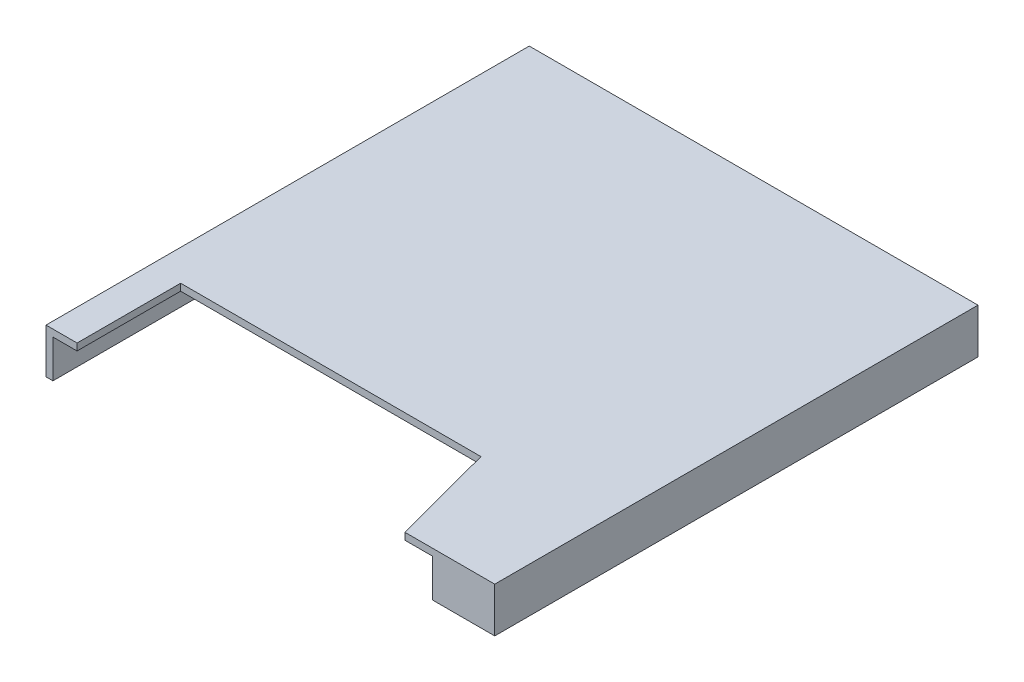
ISO-10303-21;
HEADER;
FILE_DESCRIPTION(('STEP AP214'),'2;1');
FILE_NAME('part.step','',(''),(''),'','','');
FILE_SCHEMA(('AUTOMOTIVE_DESIGN { 1 0 10303 214 1 1 1 1 }'));
ENDSEC;
DATA;
#1=APPLICATION_CONTEXT('core data for automotive mechanical design processes');
#2=APPLICATION_PROTOCOL_DEFINITION('international standard','automotive_design',2000,#1);
#3=PRODUCT_CONTEXT('',#1,'mechanical');
#4=PRODUCT('Part','Part','',(#3));
#5=PRODUCT_RELATED_PRODUCT_CATEGORY('part','',(#4));
#6=PRODUCT_DEFINITION_FORMATION('','',#4);
#7=PRODUCT_DEFINITION_CONTEXT('part definition',#1,'design');
#8=PRODUCT_DEFINITION('design','',#6,#7);
#9=PRODUCT_DEFINITION_SHAPE('','',#8);
#10=(LENGTH_UNIT() NAMED_UNIT(*) SI_UNIT(.MILLI.,.METRE.));
#11=(NAMED_UNIT(*) PLANE_ANGLE_UNIT() SI_UNIT($,.RADIAN.));
#12=(NAMED_UNIT(*) SI_UNIT($,.STERADIAN.) SOLID_ANGLE_UNIT());
#13=UNCERTAINTY_MEASURE_WITH_UNIT(LENGTH_MEASURE(1.E-05),#10,'distance_accuracy_value','');
#14=(GEOMETRIC_REPRESENTATION_CONTEXT(3) GLOBAL_UNCERTAINTY_ASSIGNED_CONTEXT((#13)) GLOBAL_UNIT_ASSIGNED_CONTEXT((#10,
#11,#12)) REPRESENTATION_CONTEXT('',''));
#15=CARTESIAN_POINT('',(0.,0.,0.));
#16=DIRECTION('',(0.,0.,1.));
#17=DIRECTION('',(1.,0.,0.));
#18=AXIS2_PLACEMENT_3D('',#15,#16,#17);
#19=CARTESIAN_POINT('',(-6.3,0.,-7.));
#20=DIRECTION('',(-1.,0.,0.));
#21=DIRECTION('',(0.,0.,1.));
#22=AXIS2_PLACEMENT_3D('',#19,#20,#21);
#23=PLANE('',#22);
#24=DIRECTION('',(0.,1.,0.));
#25=VECTOR('',#24,1.);
#26=CARTESIAN_POINT('',(-6.3,0.,7.));
#27=LINE('',#26,#25);
#28=CARTESIAN_POINT('',(-6.3,0.,7.));
#29=VERTEX_POINT('',#28);
#30=CARTESIAN_POINT('',(-6.3,1.1,7.));
#31=VERTEX_POINT('',#30);
#32=EDGE_CURVE('E20',#29,#31,#27,.T.);
#33=ORIENTED_EDGE('',*,*,#32,.F.);
#34=DIRECTION('',(0.,0.,1.));
#35=VECTOR('',#34,1.);
#36=CARTESIAN_POINT('',(-6.3,0.,0.));
#37=LINE('',#36,#35);
#38=CARTESIAN_POINT('',(-6.3,0.,-6.8));
#39=VERTEX_POINT('',#38);
#40=EDGE_CURVE('E196',#29,#39,#37,.F.);
#41=ORIENTED_EDGE('',*,*,#40,.T.);
#42=DIRECTION('',(0.,1.,0.));
#43=VECTOR('',#42,1.);
#44=CARTESIAN_POINT('',(-6.3,0.,-6.8));
#45=LINE('',#44,#43);
#46=CARTESIAN_POINT('',(-6.3,1.1,-6.8));
#47=VERTEX_POINT('',#46);
#48=EDGE_CURVE('E149',#39,#47,#45,.T.);
#49=ORIENTED_EDGE('',*,*,#48,.T.);
#50=DIRECTION('',(0.,0.,1.));
#51=VECTOR('',#50,1.);
#52=CARTESIAN_POINT('',(-6.3,1.1,0.));
#53=LINE('',#52,#51);
#54=EDGE_CURVE('E145',#47,#31,#53,.T.);
#55=ORIENTED_EDGE('',*,*,#54,.T.);
#56=EDGE_LOOP('',(#33,#41,#49,#55));
#57=FACE_BOUND('',#56,.T.);
#58=ADVANCED_FACE('F17',(#57),#23,.F.);
#59=CARTESIAN_POINT('',(6.5,0.,-6.8));
#60=DIRECTION('',(0.,0.,-1.));
#61=DIRECTION('',(-1.,0.,0.));
#62=AXIS2_PLACEMENT_3D('',#59,#60,#61);
#63=PLANE('',#62);
#64=ORIENTED_EDGE('',*,*,#48,.F.);
#65=DIRECTION('',(1.,0.,0.));
#66=VECTOR('',#65,1.);
#67=CARTESIAN_POINT('',(0.,0.,-6.8));
#68=LINE('',#67,#66);
#69=CARTESIAN_POINT('',(6.3,0.,-6.8));
#70=VERTEX_POINT('',#69);
#71=EDGE_CURVE('E194',#39,#70,#68,.T.);
#72=ORIENTED_EDGE('',*,*,#71,.T.);
#73=DIRECTION('',(0.,1.,0.));
#74=VECTOR('',#73,1.);
#75=CARTESIAN_POINT('',(6.3,0.,-6.8));
#76=LINE('',#75,#74);
#77=CARTESIAN_POINT('',(6.3,1.1,-6.8));
#78=VERTEX_POINT('',#77);
#79=EDGE_CURVE('E116',#70,#78,#76,.T.);
#80=ORIENTED_EDGE('',*,*,#79,.T.);
#81=DIRECTION('',(1.,0.,0.));
#82=VECTOR('',#81,1.);
#83=CARTESIAN_POINT('',(0.,1.1,-6.8));
#84=LINE('',#83,#82);
#85=EDGE_CURVE('E143',#78,#47,#84,.F.);
#86=ORIENTED_EDGE('',*,*,#85,.T.);
#87=EDGE_LOOP('',(#64,#72,#80,#86));
#88=FACE_BOUND('',#87,.T.);
#89=ADVANCED_FACE('F378',(#88),#63,.F.);
#90=CARTESIAN_POINT('',(6.3,0.,7.));
#91=DIRECTION('',(1.,0.,0.));
#92=DIRECTION('',(0.,0.,-1.));
#93=AXIS2_PLACEMENT_3D('',#90,#91,#92);
#94=PLANE('',#93);
#95=DIRECTION('',(0.,0.,1.));
#96=VECTOR('',#95,1.);
#97=CARTESIAN_POINT('',(6.3,0.,0.));
#98=LINE('',#97,#96);
#99=CARTESIAN_POINT('',(6.3,0.,6.8));
#100=VERTEX_POINT('',#99);
#101=EDGE_CURVE('E128',#70,#100,#98,.T.);
#102=ORIENTED_EDGE('',*,*,#101,.T.);
#103=DIRECTION('',(0.,1.,0.));
#104=VECTOR('',#103,1.);
#105=CARTESIAN_POINT('',(6.3,1.1,6.8));
#106=LINE('',#105,#104);
#107=CARTESIAN_POINT('',(6.3,1.1,6.8));
#108=VERTEX_POINT('',#107);
#109=EDGE_CURVE('E121',#108,#100,#106,.F.);
#110=ORIENTED_EDGE('',*,*,#109,.F.);
#111=DIRECTION('',(0.,0.,1.));
#112=VECTOR('',#111,1.);
#113=CARTESIAN_POINT('',(6.3,1.1,0.));
#114=LINE('',#113,#112);
#115=EDGE_CURVE('E125',#108,#78,#114,.F.);
#116=ORIENTED_EDGE('',*,*,#115,.T.);
#117=ORIENTED_EDGE('',*,*,#79,.F.);
#118=EDGE_LOOP('',(#102,#110,#116,#117));
#119=FACE_BOUND('',#118,.T.);
#120=ADVANCED_FACE('F123',(#119),#94,.F.);
#121=CARTESIAN_POINT('',(4.7,1.1,6.8));
#122=DIRECTION('',(0.,0.,-1.));
#123=DIRECTION('',(-1.,0.,0.));
#124=AXIS2_PLACEMENT_3D('',#121,#122,#123);
#125=PLANE('',#124);
#126=DIRECTION('',(1.,0.,0.));
#127=VECTOR('',#126,1.);
#128=CARTESIAN_POINT('',(0.,1.1,6.8));
#129=LINE('',#128,#127);
#130=CARTESIAN_POINT('',(4.7,1.1,6.8));
#131=VERTEX_POINT('',#130);
#132=EDGE_CURVE('E131',#131,#108,#129,.T.);
#133=ORIENTED_EDGE('',*,*,#132,.T.);
#134=ORIENTED_EDGE('',*,*,#109,.T.);
#135=DIRECTION('',(1.,0.,0.));
#136=VECTOR('',#135,1.);
#137=CARTESIAN_POINT('',(0.,0.,6.8));
#138=LINE('',#137,#136);
#139=CARTESIAN_POINT('',(4.7,0.,6.8));
#140=VERTEX_POINT('',#139);
#141=EDGE_CURVE('E191',#100,#140,#138,.F.);
#142=ORIENTED_EDGE('',*,*,#141,.T.);
#143=DIRECTION('',(0.,1.,0.));
#144=VECTOR('',#143,1.);
#145=CARTESIAN_POINT('',(4.7,1.1,6.8));
#146=LINE('',#145,#144);
#147=EDGE_CURVE('E136',#131,#140,#146,.F.);
#148=ORIENTED_EDGE('',*,*,#147,.F.);
#149=EDGE_LOOP('',(#133,#134,#142,#148));
#150=FACE_BOUND('',#149,.T.);
#151=ADVANCED_FACE('F134',(#150),#125,.T.);
#152=CARTESIAN_POINT('',(0.,1.1,0.));
#153=DIRECTION('',(0.,1.,0.));
#154=DIRECTION('',(0.,0.,1.));
#155=AXIS2_PLACEMENT_3D('',#152,#153,#154);
#156=PLANE('',#155);
#157=DIRECTION('',(-0.257662650560333,0.,-0.966234939601246));
#158=VECTOR('',#157,1.);
#159=CARTESIAN_POINT('',(3.1,1.1,4.));
#160=LINE('',#159,#158);
#161=CARTESIAN_POINT('',(3.9,1.1,7.));
#162=VERTEX_POINT('',#161);
#163=CARTESIAN_POINT('',(3.1,1.1,4.));
#164=VERTEX_POINT('',#163);
#165=EDGE_CURVE('E216',#162,#164,#160,.T.);
#166=ORIENTED_EDGE('',*,*,#165,.T.);
#167=DIRECTION('',(-1.,0.,0.));
#168=VECTOR('',#167,1.);
#169=CARTESIAN_POINT('',(-5.6,1.1,4.));
#170=LINE('',#169,#168);
#171=CARTESIAN_POINT('',(-5.6,1.1,4.));
#172=VERTEX_POINT('',#171);
#173=EDGE_CURVE('E223',#164,#172,#170,.T.);
#174=ORIENTED_EDGE('',*,*,#173,.T.);
#175=DIRECTION('',(0.,0.,1.));
#176=VECTOR('',#175,1.);
#177=CARTESIAN_POINT('',(-5.6,1.1,7.));
#178=LINE('',#177,#176);
#179=CARTESIAN_POINT('',(-5.6,1.1,7.));
#180=VERTEX_POINT('',#179);
#181=EDGE_CURVE('E166',#172,#180,#178,.T.);
#182=ORIENTED_EDGE('',*,*,#181,.T.);
#183=DIRECTION('',(1.,0.,0.));
#184=VECTOR('',#183,1.);
#185=CARTESIAN_POINT('',(-6.5,1.1,7.));
#186=LINE('',#185,#184);
#187=EDGE_CURVE('E158',#31,#180,#186,.T.);
#188=ORIENTED_EDGE('',*,*,#187,.F.);
#189=ORIENTED_EDGE('',*,*,#54,.F.);
#190=ORIENTED_EDGE('',*,*,#85,.F.);
#191=ORIENTED_EDGE('',*,*,#115,.F.);
#192=ORIENTED_EDGE('',*,*,#132,.F.);
#193=DIRECTION('',(0.,0.,1.));
#194=VECTOR('',#193,1.);
#195=CARTESIAN_POINT('',(4.7,1.1,7.));
#196=LINE('',#195,#194);
#197=CARTESIAN_POINT('',(4.7,1.1,7.));
#198=VERTEX_POINT('',#197);
#199=EDGE_CURVE('E199',#198,#131,#196,.F.);
#200=ORIENTED_EDGE('',*,*,#199,.F.);
#201=DIRECTION('',(1.,0.,0.));
#202=VECTOR('',#201,1.);
#203=CARTESIAN_POINT('',(0.,1.1,7.));
#204=LINE('',#203,#202);
#205=EDGE_CURVE('E164',#162,#198,#204,.T.);
#206=ORIENTED_EDGE('',*,*,#205,.F.);
#207=EDGE_LOOP('',(#166,#174,#182,#188,#189,#190,#191,#192,#200,#206));
#208=FACE_BOUND('',#207,.T.);
#209=ADVANCED_FACE('F141',(#208),#156,.F.);
#210=CARTESIAN_POINT('',(4.7,1.1,7.));
#211=DIRECTION('',(-1.,0.,0.));
#212=DIRECTION('',(0.,0.,1.));
#213=AXIS2_PLACEMENT_3D('',#210,#211,#212);
#214=PLANE('',#213);
#215=ORIENTED_EDGE('',*,*,#199,.T.);
#216=ORIENTED_EDGE('',*,*,#147,.T.);
#217=DIRECTION('',(0.,0.,1.));
#218=VECTOR('',#217,1.);
#219=CARTESIAN_POINT('',(4.7,0.,0.));
#220=LINE('',#219,#218);
#221=CARTESIAN_POINT('',(4.7,0.,7.));
#222=VERTEX_POINT('',#221);
#223=EDGE_CURVE('E189',#140,#222,#220,.T.);
#224=ORIENTED_EDGE('',*,*,#223,.T.);
#225=DIRECTION('',(0.,1.,0.));
#226=VECTOR('',#225,1.);
#227=CARTESIAN_POINT('',(4.7,0.,7.));
#228=LINE('',#227,#226);
#229=EDGE_CURVE('E206',#198,#222,#228,.F.);
#230=ORIENTED_EDGE('',*,*,#229,.F.);
#231=EDGE_LOOP('',(#215,#216,#224,#230));
#232=FACE_BOUND('',#231,.T.);
#233=ADVANCED_FACE('F208',(#232),#214,.T.);
#234=CARTESIAN_POINT('',(0.,0.,0.));
#235=DIRECTION('',(0.,1.,0.));
#236=DIRECTION('',(0.,0.,1.));
#237=AXIS2_PLACEMENT_3D('',#234,#235,#236);
#238=PLANE('',#237);
#239=DIRECTION('',(-1.,0.,0.));
#240=VECTOR('',#239,1.);
#241=CARTESIAN_POINT('',(6.5,0.,-7.));
#242=LINE('',#241,#240);
#243=CARTESIAN_POINT('',(6.5,0.,-7.));
#244=VERTEX_POINT('',#243);
#245=CARTESIAN_POINT('',(-6.5,0.,-7.));
#246=VERTEX_POINT('',#245);
#247=EDGE_CURVE('E183',#244,#246,#242,.T.);
#248=ORIENTED_EDGE('',*,*,#247,.F.);
#249=DIRECTION('',(0.,0.,-1.));
#250=VECTOR('',#249,1.);
#251=CARTESIAN_POINT('',(6.5,0.,7.));
#252=LINE('',#251,#250);
#253=CARTESIAN_POINT('',(6.5,0.,7.));
#254=VERTEX_POINT('',#253);
#255=EDGE_CURVE('E186',#254,#244,#252,.T.);
#256=ORIENTED_EDGE('',*,*,#255,.F.);
#257=DIRECTION('',(1.,0.,0.));
#258=VECTOR('',#257,1.);
#259=CARTESIAN_POINT('',(-6.5,0.,7.));
#260=LINE('',#259,#258);
#261=EDGE_CURVE('E211',#222,#254,#260,.T.);
#262=ORIENTED_EDGE('',*,*,#261,.F.);
#263=ORIENTED_EDGE('',*,*,#223,.F.);
#264=ORIENTED_EDGE('',*,*,#141,.F.);
#265=ORIENTED_EDGE('',*,*,#101,.F.);
#266=ORIENTED_EDGE('',*,*,#71,.F.);
#267=ORIENTED_EDGE('',*,*,#40,.F.);
#268=DIRECTION('',(1.,0.,0.));
#269=VECTOR('',#268,1.);
#270=CARTESIAN_POINT('',(-6.5,0.,7.));
#271=LINE('',#270,#269);
#272=CARTESIAN_POINT('',(-6.5,0.,7.));
#273=VERTEX_POINT('',#272);
#274=EDGE_CURVE('E162',#273,#29,#271,.T.);
#275=ORIENTED_EDGE('',*,*,#274,.F.);
#276=DIRECTION('',(0.,0.,1.));
#277=VECTOR('',#276,1.);
#278=CARTESIAN_POINT('',(-6.5,0.,-7.));
#279=LINE('',#278,#277);
#280=EDGE_CURVE('E178',#246,#273,#279,.T.);
#281=ORIENTED_EDGE('',*,*,#280,.F.);
#282=EDGE_LOOP('',(#248,#256,#262,#263,#264,#265,#266,#267,#275,#281));
#283=FACE_BOUND('',#282,.T.);
#284=ADVANCED_FACE('F336',(#283),#238,.F.);
#285=CARTESIAN_POINT('',(6.5,0.,7.));
#286=DIRECTION('',(1.,0.,0.));
#287=DIRECTION('',(0.,0.,-1.));
#288=AXIS2_PLACEMENT_3D('',#285,#286,#287);
#289=PLANE('',#288);
#290=DIRECTION('',(0.,0.,1.));
#291=VECTOR('',#290,1.);
#292=CARTESIAN_POINT('',(6.5,1.3,0.));
#293=LINE('',#292,#291);
#294=CARTESIAN_POINT('',(6.5,1.3,7.));
#295=VERTEX_POINT('',#294);
#296=CARTESIAN_POINT('',(6.5,1.3,-7.));
#297=VERTEX_POINT('',#296);
#298=EDGE_CURVE('E250',#295,#297,#293,.F.);
#299=ORIENTED_EDGE('',*,*,#298,.F.);
#300=DIRECTION('',(0.,1.,0.));
#301=VECTOR('',#300,1.);
#302=CARTESIAN_POINT('',(6.5,0.,7.));
#303=LINE('',#302,#301);
#304=EDGE_CURVE('E214',#254,#295,#303,.T.);
#305=ORIENTED_EDGE('',*,*,#304,.F.);
#306=ORIENTED_EDGE('',*,*,#255,.T.);
#307=DIRECTION('',(0.,1.,0.));
#308=VECTOR('',#307,1.);
#309=CARTESIAN_POINT('',(6.5,0.,-7.));
#310=LINE('',#309,#308);
#311=EDGE_CURVE('E180',#297,#244,#310,.F.);
#312=ORIENTED_EDGE('',*,*,#311,.F.);
#313=EDGE_LOOP('',(#299,#305,#306,#312));
#314=FACE_BOUND('',#313,.T.);
#315=ADVANCED_FACE('F326',(#314),#289,.T.);
#316=CARTESIAN_POINT('',(6.5,0.,-7.));
#317=DIRECTION('',(0.,0.,-1.));
#318=DIRECTION('',(-1.,0.,0.));
#319=AXIS2_PLACEMENT_3D('',#316,#317,#318);
#320=PLANE('',#319);
#321=DIRECTION('',(1.,0.,0.));
#322=VECTOR('',#321,1.);
#323=CARTESIAN_POINT('',(0.,1.3,-7.));
#324=LINE('',#323,#322);
#325=CARTESIAN_POINT('',(-6.5,1.3,-7.));
#326=VERTEX_POINT('',#325);
#327=EDGE_CURVE('E245',#297,#326,#324,.F.);
#328=ORIENTED_EDGE('',*,*,#327,.F.);
#329=ORIENTED_EDGE('',*,*,#311,.T.);
#330=ORIENTED_EDGE('',*,*,#247,.T.);
#331=DIRECTION('',(0.,1.,0.));
#332=VECTOR('',#331,1.);
#333=CARTESIAN_POINT('',(-6.5,0.,-7.));
#334=LINE('',#333,#332);
#335=EDGE_CURVE('E175',#326,#246,#334,.F.);
#336=ORIENTED_EDGE('',*,*,#335,.F.);
#337=EDGE_LOOP('',(#328,#329,#330,#336));
#338=FACE_BOUND('',#337,.T.);
#339=ADVANCED_FACE('F316',(#338),#320,.T.);
#340=CARTESIAN_POINT('',(-6.5,0.,-7.));
#341=DIRECTION('',(-1.,0.,0.));
#342=DIRECTION('',(0.,0.,1.));
#343=AXIS2_PLACEMENT_3D('',#340,#341,#342);
#344=PLANE('',#343);
#345=DIRECTION('',(0.,0.,1.));
#346=VECTOR('',#345,1.);
#347=CARTESIAN_POINT('',(-6.5,1.3,0.));
#348=LINE('',#347,#346);
#349=CARTESIAN_POINT('',(-6.5,1.3,7.));
#350=VERTEX_POINT('',#349);
#351=EDGE_CURVE('E243',#326,#350,#348,.T.);
#352=ORIENTED_EDGE('',*,*,#351,.F.);
#353=ORIENTED_EDGE('',*,*,#335,.T.);
#354=ORIENTED_EDGE('',*,*,#280,.T.);
#355=DIRECTION('',(0.,1.,0.));
#356=VECTOR('',#355,1.);
#357=CARTESIAN_POINT('',(-6.5,0.,7.));
#358=LINE('',#357,#356);
#359=EDGE_CURVE('E170',#350,#273,#358,.F.);
#360=ORIENTED_EDGE('',*,*,#359,.F.);
#361=EDGE_LOOP('',(#352,#353,#354,#360));
#362=FACE_BOUND('',#361,.T.);
#363=ADVANCED_FACE('F307',(#362),#344,.T.);
#364=CARTESIAN_POINT('',(-6.5,0.,7.));
#365=DIRECTION('',(0.,0.,1.));
#366=DIRECTION('',(1.,0.,0.));
#367=AXIS2_PLACEMENT_3D('',#364,#365,#366);
#368=PLANE('',#367);
#369=DIRECTION('',(0.,1.,0.));
#370=VECTOR('',#369,1.);
#371=CARTESIAN_POINT('',(-5.6,1.3,7.));
#372=LINE('',#371,#370);
#373=CARTESIAN_POINT('',(-5.6,1.3,7.));
#374=VERTEX_POINT('',#373);
#375=EDGE_CURVE('E168',#180,#374,#372,.T.);
#376=ORIENTED_EDGE('',*,*,#375,.T.);
#377=DIRECTION('',(1.,0.,0.));
#378=VECTOR('',#377,1.);
#379=CARTESIAN_POINT('',(0.,1.3,7.));
#380=LINE('',#379,#378);
#381=EDGE_CURVE('E227',#350,#374,#380,.T.);
#382=ORIENTED_EDGE('',*,*,#381,.F.);
#383=ORIENTED_EDGE('',*,*,#359,.T.);
#384=ORIENTED_EDGE('',*,*,#274,.T.);
#385=ORIENTED_EDGE('',*,*,#32,.T.);
#386=ORIENTED_EDGE('',*,*,#187,.T.);
#387=EDGE_LOOP('',(#376,#382,#383,#384,#385,#386));
#388=FACE_BOUND('',#387,.T.);
#389=ADVANCED_FACE('F156',(#388),#368,.T.);
#390=CARTESIAN_POINT('',(-5.6,1.3,7.));
#391=DIRECTION('',(-1.,0.,0.));
#392=DIRECTION('',(0.,0.,1.));
#393=AXIS2_PLACEMENT_3D('',#390,#391,#392);
#394=PLANE('',#393);
#395=ORIENTED_EDGE('',*,*,#375,.F.);
#396=ORIENTED_EDGE('',*,*,#181,.F.);
#397=DIRECTION('',(0.,1.,0.));
#398=VECTOR('',#397,1.);
#399=CARTESIAN_POINT('',(-5.6,1.3,4.));
#400=LINE('',#399,#398);
#401=CARTESIAN_POINT('',(-5.6,1.3,4.));
#402=VERTEX_POINT('',#401);
#403=EDGE_CURVE('E221',#172,#402,#400,.T.);
#404=ORIENTED_EDGE('',*,*,#403,.T.);
#405=DIRECTION('',(0.,0.,1.));
#406=VECTOR('',#405,1.);
#407=CARTESIAN_POINT('',(-5.6,1.3,0.));
#408=LINE('',#407,#406);
#409=EDGE_CURVE('E231',#374,#402,#408,.F.);
#410=ORIENTED_EDGE('',*,*,#409,.F.);
#411=EDGE_LOOP('',(#395,#396,#404,#410));
#412=FACE_BOUND('',#411,.T.);
#413=ADVANCED_FACE('F232',(#412),#394,.F.);
#414=CARTESIAN_POINT('',(-5.6,1.3,4.));
#415=DIRECTION('',(0.,0.,-1.));
#416=DIRECTION('',(-1.,0.,0.));
#417=AXIS2_PLACEMENT_3D('',#414,#415,#416);
#418=PLANE('',#417);
#419=ORIENTED_EDGE('',*,*,#403,.F.);
#420=ORIENTED_EDGE('',*,*,#173,.F.);
#421=DIRECTION('',(0.,1.,0.));
#422=VECTOR('',#421,1.);
#423=CARTESIAN_POINT('',(3.1,1.3,4.));
#424=LINE('',#423,#422);
#425=CARTESIAN_POINT('',(3.1,1.3,4.));
#426=VERTEX_POINT('',#425);
#427=EDGE_CURVE('E212',#164,#426,#424,.T.);
#428=ORIENTED_EDGE('',*,*,#427,.T.);
#429=DIRECTION('',(1.,0.,0.));
#430=VECTOR('',#429,1.);
#431=CARTESIAN_POINT('',(0.,1.3,4.));
#432=LINE('',#431,#430);
#433=EDGE_CURVE('E237',#402,#426,#432,.T.);
#434=ORIENTED_EDGE('',*,*,#433,.F.);
#435=EDGE_LOOP('',(#419,#420,#428,#434));
#436=FACE_BOUND('',#435,.T.);
#437=ADVANCED_FACE('F261',(#436),#418,.F.);
#438=CARTESIAN_POINT('',(3.1,1.3,4.));
#439=DIRECTION('',(0.966234939601246,0.,-0.257662650560333));
#440=DIRECTION('',(-0.257662650560333,0.,-0.966234939601246));
#441=AXIS2_PLACEMENT_3D('',#438,#439,#440);
#442=PLANE('',#441);
#443=ORIENTED_EDGE('',*,*,#427,.F.);
#444=ORIENTED_EDGE('',*,*,#165,.F.);
#445=DIRECTION('',(0.,1.,0.));
#446=VECTOR('',#445,1.);
#447=CARTESIAN_POINT('',(3.9,0.,7.));
#448=LINE('',#447,#446);
#449=CARTESIAN_POINT('',(3.9,1.3,7.));
#450=VERTEX_POINT('',#449);
#451=EDGE_CURVE('E35',#450,#162,#448,.F.);
#452=ORIENTED_EDGE('',*,*,#451,.F.);
#453=DIRECTION('',(0.257662650560333,0.,0.966234939601246));
#454=VECTOR('',#453,1.);
#455=CARTESIAN_POINT('',(3.1,1.3,4.));
#456=LINE('',#455,#454);
#457=EDGE_CURVE('E26',#426,#450,#456,.T.);
#458=ORIENTED_EDGE('',*,*,#457,.F.);
#459=EDGE_LOOP('',(#443,#444,#452,#458));
#460=FACE_BOUND('',#459,.T.);
#461=ADVANCED_FACE('F258',(#460),#442,.F.);
#462=CARTESIAN_POINT('',(-6.5,0.,7.));
#463=DIRECTION('',(0.,0.,1.));
#464=DIRECTION('',(1.,0.,0.));
#465=AXIS2_PLACEMENT_3D('',#462,#463,#464);
#466=PLANE('',#465);
#467=ORIENTED_EDGE('',*,*,#451,.T.);
#468=ORIENTED_EDGE('',*,*,#205,.T.);
#469=ORIENTED_EDGE('',*,*,#229,.T.);
#470=ORIENTED_EDGE('',*,*,#261,.T.);
#471=ORIENTED_EDGE('',*,*,#304,.T.);
#472=DIRECTION('',(1.,0.,0.));
#473=VECTOR('',#472,1.);
#474=CARTESIAN_POINT('',(0.,1.3,7.));
#475=LINE('',#474,#473);
#476=EDGE_CURVE('E11',#450,#295,#475,.T.);
#477=ORIENTED_EDGE('',*,*,#476,.F.);
#478=EDGE_LOOP('',(#467,#468,#469,#470,#471,#477));
#479=FACE_BOUND('',#478,.T.);
#480=ADVANCED_FACE('F203',(#479),#466,.T.);
#481=CARTESIAN_POINT('',(0.,1.3,0.));
#482=DIRECTION('',(0.,1.,0.));
#483=DIRECTION('',(0.,0.,1.));
#484=AXIS2_PLACEMENT_3D('',#481,#482,#483);
#485=PLANE('',#484);
#486=ORIENTED_EDGE('',*,*,#457,.T.);
#487=ORIENTED_EDGE('',*,*,#476,.T.);
#488=ORIENTED_EDGE('',*,*,#298,.T.);
#489=ORIENTED_EDGE('',*,*,#327,.T.);
#490=ORIENTED_EDGE('',*,*,#351,.T.);
#491=ORIENTED_EDGE('',*,*,#381,.T.);
#492=ORIENTED_EDGE('',*,*,#409,.T.);
#493=ORIENTED_EDGE('',*,*,#433,.T.);
#494=EDGE_LOOP('',(#486,#487,#488,#489,#490,#491,#492,#493));
#495=FACE_BOUND('',#494,.T.);
#496=ADVANCED_FACE('F240',(#495),#485,.T.);
#497=CLOSED_SHELL('',(#58,#89,#120,#151,#209,#233,#284,#315,#339,#363,#389,#413,#437,#461,#480,#496));
#498=MANIFOLD_SOLID_BREP('B1',#497);
#499=ADVANCED_BREP_SHAPE_REPRESENTATION('',(#18,#498),#14);
#500=SHAPE_DEFINITION_REPRESENTATION(#9,#499);
ENDSEC;
END-ISO-10303-21;
